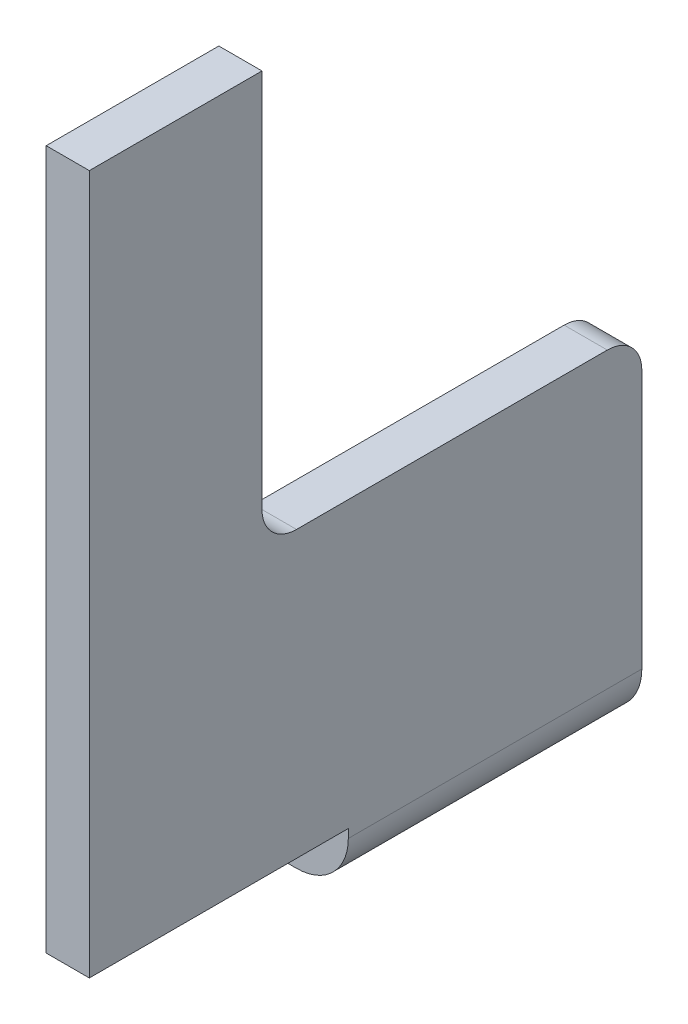
ISO-10303-21;
HEADER;
FILE_DESCRIPTION(('STEP AP214'),'2;1');
FILE_NAME('part.step','',(''),(''),'','','');
FILE_SCHEMA(('AUTOMOTIVE_DESIGN { 1 0 10303 214 1 1 1 1 }'));
ENDSEC;
DATA;
#1=APPLICATION_CONTEXT('core data for automotive mechanical design processes');
#2=APPLICATION_PROTOCOL_DEFINITION('international standard','automotive_design',2000,#1);
#3=PRODUCT_CONTEXT('',#1,'mechanical');
#4=PRODUCT('Part','Part','',(#3));
#5=PRODUCT_RELATED_PRODUCT_CATEGORY('part','',(#4));
#6=PRODUCT_DEFINITION_FORMATION('','',#4);
#7=PRODUCT_DEFINITION_CONTEXT('part definition',#1,'design');
#8=PRODUCT_DEFINITION('design','',#6,#7);
#9=PRODUCT_DEFINITION_SHAPE('','',#8);
#10=(LENGTH_UNIT() NAMED_UNIT(*) SI_UNIT(.MILLI.,.METRE.));
#11=(NAMED_UNIT(*) PLANE_ANGLE_UNIT() SI_UNIT($,.RADIAN.));
#12=(NAMED_UNIT(*) SI_UNIT($,.STERADIAN.) SOLID_ANGLE_UNIT());
#13=UNCERTAINTY_MEASURE_WITH_UNIT(LENGTH_MEASURE(1.E-05),#10,'distance_accuracy_value','');
#14=(GEOMETRIC_REPRESENTATION_CONTEXT(3) GLOBAL_UNCERTAINTY_ASSIGNED_CONTEXT((#13)) GLOBAL_UNIT_ASSIGNED_CONTEXT((#10,
#11,#12)) REPRESENTATION_CONTEXT('',''));
#15=CARTESIAN_POINT('',(0.,0.,0.));
#16=DIRECTION('',(0.,0.,1.));
#17=DIRECTION('',(1.,0.,0.));
#18=AXIS2_PLACEMENT_3D('',#15,#16,#17);
#19=CARTESIAN_POINT('',(2.375,-2.05,-10.4));
#20=DIRECTION('',(0.,0.,-1.));
#21=DIRECTION('',(-1.,0.,0.));
#22=AXIS2_PLACEMENT_3D('',#19,#20,#21);
#23=CYLINDRICAL_SURFACE('',#22,0.0999999999999998);
#24=DIRECTION('',(0.,0.,-1.));
#25=VECTOR('',#24,1.);
#26=CARTESIAN_POINT('',(2.475,-2.05,-8.2));
#27=LINE('',#26,#25);
#28=CARTESIAN_POINT('',(2.475,-2.05,-8.7));
#29=VERTEX_POINT('',#28);
#30=CARTESIAN_POINT('',(2.475,-2.05,-10.4));
#31=VERTEX_POINT('',#30);
#32=EDGE_CURVE('E226',#29,#31,#27,.T.);
#33=ORIENTED_EDGE('',*,*,#32,.T.);
#34=CARTESIAN_POINT('',(2.375,-2.05,-10.4));
#35=DIRECTION('',(0.,0.,-1.));
#36=DIRECTION('',(-1.,0.,0.));
#37=AXIS2_PLACEMENT_3D('',#34,#35,#36);
#38=CIRCLE('',#37,0.0999999999999998);
#39=CARTESIAN_POINT('',(2.375,-2.15,-10.4));
#40=VERTEX_POINT('',#39);
#41=EDGE_CURVE('E21',#40,#31,#38,.F.);
#42=ORIENTED_EDGE('',*,*,#41,.F.);
#43=DIRECTION('',(0.,0.,-1.));
#44=VECTOR('',#43,1.);
#45=CARTESIAN_POINT('',(2.375,-2.15,-10.4));
#46=LINE('',#45,#44);
#47=CARTESIAN_POINT('',(2.375,-2.15,-8.7));
#48=VERTEX_POINT('',#47);
#49=EDGE_CURVE('E193',#40,#48,#46,.F.);
#50=ORIENTED_EDGE('',*,*,#49,.T.);
#51=CARTESIAN_POINT('',(2.375,-2.05,-8.7));
#52=DIRECTION('',(0.,0.,-1.));
#53=DIRECTION('',(-1.,0.,0.));
#54=AXIS2_PLACEMENT_3D('',#51,#52,#53);
#55=CIRCLE('',#54,0.0999999999999998);
#56=EDGE_CURVE('E265',#29,#48,#55,.T.);
#57=ORIENTED_EDGE('',*,*,#56,.F.);
#58=EDGE_LOOP('',(#33,#42,#50,#57));
#59=FACE_BOUND('',#58,.T.);
#60=ADVANCED_FACE('F18',(#59),#23,.F.);
#61=CARTESIAN_POINT('',(1.375,-2.15,-9.25));
#62=DIRECTION('',(0.,1.,0.));
#63=DIRECTION('',(0.,0.,1.));
#64=AXIS2_PLACEMENT_3D('',#61,#62,#63);
#65=CYLINDRICAL_SURFACE('',#64,0.100000000000001);
#66=CARTESIAN_POINT('',(1.375,-2.15,-9.25));
#67=DIRECTION('',(0.,1.,0.));
#68=DIRECTION('',(0.,0.,1.));
#69=AXIS2_PLACEMENT_3D('',#66,#67,#68);
#70=CIRCLE('',#69,0.100000000000001);
#71=CARTESIAN_POINT('',(1.275,-2.15,-9.25));
#72=VERTEX_POINT('',#71);
#73=CARTESIAN_POINT('',(1.375,-2.15,-9.35));
#74=VERTEX_POINT('',#73);
#75=EDGE_CURVE('E190',#72,#74,#70,.F.);
#76=ORIENTED_EDGE('',*,*,#75,.T.);
#77=DIRECTION('',(0.,-1.,0.));
#78=VECTOR('',#77,1.);
#79=CARTESIAN_POINT('',(1.375,-2.15,-9.35));
#80=LINE('',#79,#78);
#81=CARTESIAN_POINT('',(1.375,-2.4,-9.35));
#82=VERTEX_POINT('',#81);
#83=EDGE_CURVE('E263',#74,#82,#80,.T.);
#84=ORIENTED_EDGE('',*,*,#83,.T.);
#85=CARTESIAN_POINT('',(1.375,-2.4,-9.25));
#86=DIRECTION('',(0.,1.,0.));
#87=DIRECTION('',(0.,0.,1.));
#88=AXIS2_PLACEMENT_3D('',#85,#86,#87);
#89=CIRCLE('',#88,0.100000000000001);
#90=CARTESIAN_POINT('',(1.275,-2.4,-9.25));
#91=VERTEX_POINT('',#90);
#92=EDGE_CURVE('E154',#82,#91,#89,.T.);
#93=ORIENTED_EDGE('',*,*,#92,.T.);
#94=DIRECTION('',(0.,1.,0.));
#95=VECTOR('',#94,1.);
#96=CARTESIAN_POINT('',(1.275,-2.4,-9.25));
#97=LINE('',#96,#95);
#98=EDGE_CURVE('E148',#91,#72,#97,.T.);
#99=ORIENTED_EDGE('',*,*,#98,.T.);
#100=EDGE_LOOP('',(#76,#84,#93,#99));
#101=FACE_BOUND('',#100,.T.);
#102=ADVANCED_FACE('F556',(#101),#65,.T.);
#103=CARTESIAN_POINT('',(1.8,-2.15,-9.35));
#104=DIRECTION('',(0.,0.,1.));
#105=DIRECTION('',(0.,-1.,0.));
#106=AXIS2_PLACEMENT_3D('',#103,#104,#105);
#107=PLANE('',#106);
#108=ORIENTED_EDGE('',*,*,#83,.F.);
#109=DIRECTION('',(1.,0.,0.));
#110=VECTOR('',#109,1.);
#111=CARTESIAN_POINT('',(1.275,-2.15,-9.35));
#112=LINE('',#111,#110);
#113=CARTESIAN_POINT('',(1.8,-2.15,-9.35));
#114=VERTEX_POINT('',#113);
#115=EDGE_CURVE('E187',#74,#114,#112,.T.);
#116=ORIENTED_EDGE('',*,*,#115,.T.);
#117=DIRECTION('',(0.,1.,0.));
#118=VECTOR('',#117,1.);
#119=CARTESIAN_POINT('',(1.8,-2.15,-9.35));
#120=LINE('',#119,#118);
#121=CARTESIAN_POINT('',(1.8,-2.4,-9.35));
#122=VERTEX_POINT('',#121);
#123=EDGE_CURVE('E261',#114,#122,#120,.F.);
#124=ORIENTED_EDGE('',*,*,#123,.T.);
#125=DIRECTION('',(1.,0.,0.));
#126=VECTOR('',#125,1.);
#127=CARTESIAN_POINT('',(2.425,-2.4,-9.35));
#128=LINE('',#127,#126);
#129=EDGE_CURVE('E213',#122,#82,#128,.F.);
#130=ORIENTED_EDGE('',*,*,#129,.T.);
#131=EDGE_LOOP('',(#108,#116,#124,#130));
#132=FACE_BOUND('',#131,.T.);
#133=ADVANCED_FACE('F546',(#132),#107,.F.);
#134=CARTESIAN_POINT('',(1.8,-2.15,-9.55));
#135=DIRECTION('',(0.,1.,0.));
#136=DIRECTION('',(0.,0.,1.));
#137=AXIS2_PLACEMENT_3D('',#134,#135,#136);
#138=CYLINDRICAL_SURFACE('',#137,0.200000000000001);
#139=ORIENTED_EDGE('',*,*,#123,.F.);
#140=CARTESIAN_POINT('',(1.8,-2.15,-9.55));
#141=DIRECTION('',(0.,1.,0.));
#142=DIRECTION('',(0.,0.,1.));
#143=AXIS2_PLACEMENT_3D('',#140,#141,#142);
#144=CIRCLE('',#143,0.200000000000001);
#145=CARTESIAN_POINT('',(1.8,-2.15,-9.75));
#146=VERTEX_POINT('',#145);
#147=EDGE_CURVE('E186',#114,#146,#144,.T.);
#148=ORIENTED_EDGE('',*,*,#147,.T.);
#149=DIRECTION('',(0.,1.,0.));
#150=VECTOR('',#149,1.);
#151=CARTESIAN_POINT('',(1.8,-2.15,-9.75));
#152=LINE('',#151,#150);
#153=CARTESIAN_POINT('',(1.8,-2.4,-9.75));
#154=VERTEX_POINT('',#153);
#155=EDGE_CURVE('E258',#146,#154,#152,.F.);
#156=ORIENTED_EDGE('',*,*,#155,.T.);
#157=CARTESIAN_POINT('',(1.8,-2.4,-9.55));
#158=DIRECTION('',(0.,1.,0.));
#159=DIRECTION('',(0.,0.,1.));
#160=AXIS2_PLACEMENT_3D('',#157,#158,#159);
#161=CIRCLE('',#160,0.200000000000001);
#162=EDGE_CURVE('E216',#154,#122,#161,.F.);
#163=ORIENTED_EDGE('',*,*,#162,.T.);
#164=EDGE_LOOP('',(#139,#148,#156,#163));
#165=FACE_BOUND('',#164,.T.);
#166=ADVANCED_FACE('F536',(#165),#138,.F.);
#167=CARTESIAN_POINT('',(1.8,-2.15,-9.75));
#168=DIRECTION('',(0.,0.,-1.));
#169=DIRECTION('',(-1.,0.,0.));
#170=AXIS2_PLACEMENT_3D('',#167,#168,#169);
#171=PLANE('',#170);
#172=ORIENTED_EDGE('',*,*,#155,.F.);
#173=DIRECTION('',(1.,0.,0.));
#174=VECTOR('',#173,1.);
#175=CARTESIAN_POINT('',(1.275,-2.15,-9.75));
#176=LINE('',#175,#174);
#177=CARTESIAN_POINT('',(1.375,-2.15,-9.75));
#178=VERTEX_POINT('',#177);
#179=EDGE_CURVE('E183',#146,#178,#176,.F.);
#180=ORIENTED_EDGE('',*,*,#179,.T.);
#181=DIRECTION('',(0.,1.,0.));
#182=VECTOR('',#181,1.);
#183=CARTESIAN_POINT('',(1.375,-2.15,-9.75));
#184=LINE('',#183,#182);
#185=CARTESIAN_POINT('',(1.375,-2.4,-9.75));
#186=VERTEX_POINT('',#185);
#187=EDGE_CURVE('E256',#186,#178,#184,.T.);
#188=ORIENTED_EDGE('',*,*,#187,.F.);
#189=DIRECTION('',(1.,0.,0.));
#190=VECTOR('',#189,1.);
#191=CARTESIAN_POINT('',(2.425,-2.4,-9.75));
#192=LINE('',#191,#190);
#193=EDGE_CURVE('E208',#186,#154,#192,.T.);
#194=ORIENTED_EDGE('',*,*,#193,.T.);
#195=EDGE_LOOP('',(#172,#180,#188,#194));
#196=FACE_BOUND('',#195,.T.);
#197=ADVANCED_FACE('F526',(#196),#171,.F.);
#198=CARTESIAN_POINT('',(1.375,-2.15,-9.85));
#199=DIRECTION('',(0.,1.,0.));
#200=DIRECTION('',(0.,0.,1.));
#201=AXIS2_PLACEMENT_3D('',#198,#199,#200);
#202=CYLINDRICAL_SURFACE('',#201,0.100000000000001);
#203=CARTESIAN_POINT('',(1.375,-2.15,-9.85));
#204=DIRECTION('',(0.,1.,0.));
#205=DIRECTION('',(0.,0.,1.));
#206=AXIS2_PLACEMENT_3D('',#203,#204,#205);
#207=CIRCLE('',#206,0.100000000000001);
#208=CARTESIAN_POINT('',(1.275,-2.15,-9.85));
#209=VERTEX_POINT('',#208);
#210=EDGE_CURVE('E180',#178,#209,#207,.F.);
#211=ORIENTED_EDGE('',*,*,#210,.T.);
#212=DIRECTION('',(0.,1.,0.));
#213=VECTOR('',#212,1.);
#214=CARTESIAN_POINT('',(1.275,-2.4,-9.85));
#215=LINE('',#214,#213);
#216=CARTESIAN_POINT('',(1.275,-2.4,-9.85));
#217=VERTEX_POINT('',#216);
#218=EDGE_CURVE('E205',#209,#217,#215,.F.);
#219=ORIENTED_EDGE('',*,*,#218,.T.);
#220=CARTESIAN_POINT('',(1.375,-2.4,-9.85));
#221=DIRECTION('',(0.,1.,0.));
#222=DIRECTION('',(0.,0.,1.));
#223=AXIS2_PLACEMENT_3D('',#220,#221,#222);
#224=CIRCLE('',#223,0.100000000000001);
#225=EDGE_CURVE('E153',#217,#186,#224,.T.);
#226=ORIENTED_EDGE('',*,*,#225,.T.);
#227=ORIENTED_EDGE('',*,*,#187,.T.);
#228=EDGE_LOOP('',(#211,#219,#226,#227));
#229=FACE_BOUND('',#228,.T.);
#230=ADVANCED_FACE('F517',(#229),#202,.T.);
#231=CARTESIAN_POINT('',(1.275,-2.4,-10.4));
#232=DIRECTION('',(1.,0.,0.));
#233=DIRECTION('',(0.,0.,-1.));
#234=AXIS2_PLACEMENT_3D('',#231,#232,#233);
#235=PLANE('',#234);
#236=DIRECTION('',(0.,0.,1.));
#237=VECTOR('',#236,1.);
#238=CARTESIAN_POINT('',(1.275,-2.4,-10.4));
#239=LINE('',#238,#237);
#240=CARTESIAN_POINT('',(1.275,-2.4,-8.7));
#241=VERTEX_POINT('',#240);
#242=EDGE_CURVE('E143',#91,#241,#239,.T.);
#243=ORIENTED_EDGE('',*,*,#242,.T.);
#244=DIRECTION('',(0.,1.,0.));
#245=VECTOR('',#244,1.);
#246=CARTESIAN_POINT('',(1.275,-2.05,-8.7));
#247=LINE('',#246,#245);
#248=CARTESIAN_POINT('',(1.275,-2.15,-8.7));
#249=VERTEX_POINT('',#248);
#250=EDGE_CURVE('E147',#241,#249,#247,.T.);
#251=ORIENTED_EDGE('',*,*,#250,.T.);
#252=DIRECTION('',(0.,0.,-1.));
#253=VECTOR('',#252,1.);
#254=CARTESIAN_POINT('',(1.275,-2.15,-10.4));
#255=LINE('',#254,#253);
#256=EDGE_CURVE('E191',#249,#72,#255,.T.);
#257=ORIENTED_EDGE('',*,*,#256,.T.);
#258=ORIENTED_EDGE('',*,*,#98,.F.);
#259=EDGE_LOOP('',(#243,#251,#257,#258));
#260=FACE_BOUND('',#259,.T.);
#261=ADVANCED_FACE('F145',(#260),#235,.F.);
#262=CARTESIAN_POINT('',(2.475,2.,-8.2));
#263=DIRECTION('',(1.,0.,0.));
#264=DIRECTION('',(0.,0.,-1.));
#265=AXIS2_PLACEMENT_3D('',#262,#263,#264);
#266=PLANE('',#265);
#267=CARTESIAN_POINT('',(2.475,-0.6,-10.2));
#268=DIRECTION('',(1.,0.,0.));
#269=DIRECTION('',(0.,0.,-1.));
#270=AXIS2_PLACEMENT_3D('',#267,#268,#269);
#271=CIRCLE('',#270,0.200000000000001);
#272=CARTESIAN_POINT('',(2.475,-0.6,-10.4));
#273=VERTEX_POINT('',#272);
#274=CARTESIAN_POINT('',(2.475,-0.4,-10.2));
#275=VERTEX_POINT('',#274);
#276=EDGE_CURVE('E225',#273,#275,#271,.T.);
#277=ORIENTED_EDGE('',*,*,#276,.F.);
#278=DIRECTION('',(0.,1.,0.));
#279=VECTOR('',#278,1.);
#280=CARTESIAN_POINT('',(2.475,2.,-10.4));
#281=LINE('',#280,#279);
#282=EDGE_CURVE('E223',#31,#273,#281,.T.);
#283=ORIENTED_EDGE('',*,*,#282,.F.);
#284=ORIENTED_EDGE('',*,*,#32,.F.);
#285=DIRECTION('',(0.,0.,1.));
#286=VECTOR('',#285,1.);
#287=CARTESIAN_POINT('',(2.475,-2.05,-8.2));
#288=LINE('',#287,#286);
#289=CARTESIAN_POINT('',(2.475,-2.05,-7.2));
#290=VERTEX_POINT('',#289);
#291=EDGE_CURVE('E245',#29,#290,#288,.T.);
#292=ORIENTED_EDGE('',*,*,#291,.T.);
#293=DIRECTION('',(0.,1.,0.));
#294=VECTOR('',#293,1.);
#295=CARTESIAN_POINT('',(2.475,-2.05,-7.2));
#296=LINE('',#295,#294);
#297=CARTESIAN_POINT('',(2.475,2.,-7.2));
#298=VERTEX_POINT('',#297);
#299=EDGE_CURVE('E237',#290,#298,#296,.T.);
#300=ORIENTED_EDGE('',*,*,#299,.T.);
#301=DIRECTION('',(0.,0.,-1.));
#302=VECTOR('',#301,1.);
#303=CARTESIAN_POINT('',(2.475,2.,-8.2));
#304=LINE('',#303,#302);
#305=CARTESIAN_POINT('',(2.475,2.,-8.2));
#306=VERTEX_POINT('',#305);
#307=EDGE_CURVE('E234',#298,#306,#304,.T.);
#308=ORIENTED_EDGE('',*,*,#307,.T.);
#309=DIRECTION('',(0.,1.,0.));
#310=VECTOR('',#309,1.);
#311=CARTESIAN_POINT('',(2.475,-2.05,-8.2));
#312=LINE('',#311,#310);
#313=CARTESIAN_POINT('',(2.475,-0.2,-8.2));
#314=VERTEX_POINT('',#313);
#315=EDGE_CURVE('E227',#314,#306,#312,.T.);
#316=ORIENTED_EDGE('',*,*,#315,.F.);
#317=CARTESIAN_POINT('',(2.475,-0.2,-8.4));
#318=DIRECTION('',(-1.,0.,0.));
#319=DIRECTION('',(0.,0.,1.));
#320=AXIS2_PLACEMENT_3D('',#317,#318,#319);
#321=CIRCLE('',#320,0.200000000000001);
#322=CARTESIAN_POINT('',(2.475,-0.4,-8.4));
#323=VERTEX_POINT('',#322);
#324=EDGE_CURVE('E277',#314,#323,#321,.F.);
#325=ORIENTED_EDGE('',*,*,#324,.T.);
#326=DIRECTION('',(0.,0.,-1.));
#327=VECTOR('',#326,1.);
#328=CARTESIAN_POINT('',(2.475,-0.4,-8.7));
#329=LINE('',#328,#327);
#330=EDGE_CURVE('E218',#323,#275,#329,.T.);
#331=ORIENTED_EDGE('',*,*,#330,.T.);
#332=EDGE_LOOP('',(#277,#283,#284,#292,#300,#308,#316,#325,#331));
#333=FACE_BOUND('',#332,.T.);
#334=ADVANCED_FACE('F296',(#333),#266,.F.);
#335=CARTESIAN_POINT('',(2.425,-2.4,-10.4));
#336=DIRECTION('',(0.,1.,0.));
#337=DIRECTION('',(0.,0.,1.));
#338=AXIS2_PLACEMENT_3D('',#335,#336,#337);
#339=PLANE('',#338);
#340=ORIENTED_EDGE('',*,*,#225,.F.);
#341=DIRECTION('',(0.,0.,-1.));
#342=VECTOR('',#341,1.);
#343=CARTESIAN_POINT('',(1.275,-2.4,-10.4));
#344=LINE('',#343,#342);
#345=CARTESIAN_POINT('',(1.275,-2.4,-10.4));
#346=VERTEX_POINT('',#345);
#347=EDGE_CURVE('E197',#217,#346,#344,.T.);
#348=ORIENTED_EDGE('',*,*,#347,.T.);
#349=DIRECTION('',(-1.,0.,0.));
#350=VECTOR('',#349,1.);
#351=CARTESIAN_POINT('',(2.375,-2.4,-10.4));
#352=LINE('',#351,#350);
#353=CARTESIAN_POINT('',(2.425,-2.4,-10.4));
#354=VERTEX_POINT('',#353);
#355=EDGE_CURVE('E200',#354,#346,#352,.T.);
#356=ORIENTED_EDGE('',*,*,#355,.F.);
#357=DIRECTION('',(0.,0.,-1.));
#358=VECTOR('',#357,1.);
#359=CARTESIAN_POINT('',(2.425,-2.4,-10.4));
#360=LINE('',#359,#358);
#361=CARTESIAN_POINT('',(2.425,-2.4,-8.7));
#362=VERTEX_POINT('',#361);
#363=EDGE_CURVE('E168',#362,#354,#360,.T.);
#364=ORIENTED_EDGE('',*,*,#363,.F.);
#365=DIRECTION('',(-1.,0.,0.));
#366=VECTOR('',#365,1.);
#367=CARTESIAN_POINT('',(2.375,-2.4,-8.7));
#368=LINE('',#367,#366);
#369=EDGE_CURVE('E161',#362,#241,#368,.T.);
#370=ORIENTED_EDGE('',*,*,#369,.T.);
#371=ORIENTED_EDGE('',*,*,#242,.F.);
#372=ORIENTED_EDGE('',*,*,#92,.F.);
#373=ORIENTED_EDGE('',*,*,#129,.F.);
#374=ORIENTED_EDGE('',*,*,#162,.F.);
#375=ORIENTED_EDGE('',*,*,#193,.F.);
#376=EDGE_LOOP('',(#340,#348,#356,#364,#370,#371,#372,#373,#374,#375));
#377=FACE_BOUND('',#376,.T.);
#378=ADVANCED_FACE('F166',(#377),#339,.F.);
#379=CARTESIAN_POINT('',(1.275,-2.4,-10.4));
#380=DIRECTION('',(1.,0.,0.));
#381=DIRECTION('',(0.,0.,-1.));
#382=AXIS2_PLACEMENT_3D('',#379,#380,#381);
#383=PLANE('',#382);
#384=ORIENTED_EDGE('',*,*,#218,.F.);
#385=DIRECTION('',(0.,0.,-1.));
#386=VECTOR('',#385,1.);
#387=CARTESIAN_POINT('',(1.275,-2.15,-10.4));
#388=LINE('',#387,#386);
#389=CARTESIAN_POINT('',(1.275,-2.15,-10.4));
#390=VERTEX_POINT('',#389);
#391=EDGE_CURVE('E178',#209,#390,#388,.T.);
#392=ORIENTED_EDGE('',*,*,#391,.T.);
#393=DIRECTION('',(0.,1.,0.));
#394=VECTOR('',#393,1.);
#395=CARTESIAN_POINT('',(1.275,-2.05,-10.4));
#396=LINE('',#395,#394);
#397=EDGE_CURVE('E132',#346,#390,#396,.T.);
#398=ORIENTED_EDGE('',*,*,#397,.F.);
#399=ORIENTED_EDGE('',*,*,#347,.F.);
#400=EDGE_LOOP('',(#384,#392,#398,#399));
#401=FACE_BOUND('',#400,.T.);
#402=ADVANCED_FACE('F501',(#401),#383,.F.);
#403=CARTESIAN_POINT('',(1.275,-2.15,-10.4));
#404=DIRECTION('',(0.,-1.,0.));
#405=DIRECTION('',(0.,0.,-1.));
#406=AXIS2_PLACEMENT_3D('',#403,#404,#405);
#407=PLANE('',#406);
#408=ORIENTED_EDGE('',*,*,#210,.F.);
#409=ORIENTED_EDGE('',*,*,#179,.F.);
#410=ORIENTED_EDGE('',*,*,#147,.F.);
#411=ORIENTED_EDGE('',*,*,#115,.F.);
#412=ORIENTED_EDGE('',*,*,#75,.F.);
#413=ORIENTED_EDGE('',*,*,#256,.F.);
#414=DIRECTION('',(-1.,0.,0.));
#415=VECTOR('',#414,1.);
#416=CARTESIAN_POINT('',(2.375,-2.15,-8.7));
#417=LINE('',#416,#415);
#418=EDGE_CURVE('E164',#249,#48,#417,.F.);
#419=ORIENTED_EDGE('',*,*,#418,.T.);
#420=ORIENTED_EDGE('',*,*,#49,.F.);
#421=DIRECTION('',(-1.,0.,0.));
#422=VECTOR('',#421,1.);
#423=CARTESIAN_POINT('',(2.375,-2.15,-10.4));
#424=LINE('',#423,#422);
#425=EDGE_CURVE('E199',#390,#40,#424,.F.);
#426=ORIENTED_EDGE('',*,*,#425,.F.);
#427=ORIENTED_EDGE('',*,*,#391,.F.);
#428=EDGE_LOOP('',(#408,#409,#410,#411,#412,#413,#419,#420,#426,#427));
#429=FACE_BOUND('',#428,.T.);
#430=ADVANCED_FACE('F300',(#429),#407,.F.);
#431=CARTESIAN_POINT('',(2.425,-2.1,-10.4));
#432=DIRECTION('',(0.,0.,-1.));
#433=DIRECTION('',(-1.,0.,0.));
#434=AXIS2_PLACEMENT_3D('',#431,#432,#433);
#435=CYLINDRICAL_SURFACE('',#434,0.3);
#436=CARTESIAN_POINT('',(2.425,-2.1,-10.4));
#437=DIRECTION('',(0.,0.,-1.));
#438=DIRECTION('',(-1.,0.,0.));
#439=AXIS2_PLACEMENT_3D('',#436,#437,#438);
#440=CIRCLE('',#439,0.3);
#441=CARTESIAN_POINT('',(2.725,-2.1,-10.4));
#442=VERTEX_POINT('',#441);
#443=EDGE_CURVE('E274',#442,#354,#440,.T.);
#444=ORIENTED_EDGE('',*,*,#443,.F.);
#445=DIRECTION('',(0.,0.,1.));
#446=VECTOR('',#445,1.);
#447=CARTESIAN_POINT('',(2.725,-2.1,-8.2));
#448=LINE('',#447,#446);
#449=CARTESIAN_POINT('',(2.725,-2.1,-8.7));
#450=VERTEX_POINT('',#449);
#451=EDGE_CURVE('E310',#442,#450,#448,.T.);
#452=ORIENTED_EDGE('',*,*,#451,.T.);
#453=CARTESIAN_POINT('',(2.425,-2.1,-8.7));
#454=DIRECTION('',(0.,0.,-1.));
#455=DIRECTION('',(-1.,0.,0.));
#456=AXIS2_PLACEMENT_3D('',#453,#454,#455);
#457=CIRCLE('',#456,0.3);
#458=EDGE_CURVE('E169',#450,#362,#457,.T.);
#459=ORIENTED_EDGE('',*,*,#458,.T.);
#460=ORIENTED_EDGE('',*,*,#363,.T.);
#461=EDGE_LOOP('',(#444,#452,#459,#460));
#462=FACE_BOUND('',#461,.T.);
#463=ADVANCED_FACE('F399',(#462),#435,.T.);
#464=CARTESIAN_POINT('',(2.375,-2.05,-8.7));
#465=DIRECTION('',(0.,0.,-1.));
#466=DIRECTION('',(-1.,0.,0.));
#467=AXIS2_PLACEMENT_3D('',#464,#465,#466);
#468=PLANE('',#467);
#469=DIRECTION('',(1.,0.,0.));
#470=VECTOR('',#469,1.);
#471=CARTESIAN_POINT('',(2.725,-2.05,-8.7));
#472=LINE('',#471,#470);
#473=CARTESIAN_POINT('',(2.725,-2.05,-8.7));
#474=VERTEX_POINT('',#473);
#475=EDGE_CURVE('E248',#474,#29,#472,.F.);
#476=ORIENTED_EDGE('',*,*,#475,.T.);
#477=ORIENTED_EDGE('',*,*,#56,.T.);
#478=ORIENTED_EDGE('',*,*,#418,.F.);
#479=ORIENTED_EDGE('',*,*,#250,.F.);
#480=ORIENTED_EDGE('',*,*,#369,.F.);
#481=ORIENTED_EDGE('',*,*,#458,.F.);
#482=DIRECTION('',(0.,1.,0.));
#483=VECTOR('',#482,1.);
#484=CARTESIAN_POINT('',(2.725,2.,-8.7));
#485=LINE('',#484,#483);
#486=EDGE_CURVE('E306',#450,#474,#485,.T.);
#487=ORIENTED_EDGE('',*,*,#486,.T.);
#488=EDGE_LOOP('',(#476,#477,#478,#479,#480,#481,#487));
#489=FACE_BOUND('',#488,.T.);
#490=ADVANCED_FACE('F160',(#489),#468,.F.);
#491=CARTESIAN_POINT('',(2.725,-2.05,-8.2));
#492=DIRECTION('',(0.,1.,0.));
#493=DIRECTION('',(0.,0.,1.));
#494=AXIS2_PLACEMENT_3D('',#491,#492,#493);
#495=PLANE('',#494);
#496=ORIENTED_EDGE('',*,*,#291,.F.);
#497=ORIENTED_EDGE('',*,*,#475,.F.);
#498=DIRECTION('',(0.,0.,1.));
#499=VECTOR('',#498,1.);
#500=CARTESIAN_POINT('',(2.725,-2.05,-8.2));
#501=LINE('',#500,#499);
#502=CARTESIAN_POINT('',(2.725,-2.05,-7.2));
#503=VERTEX_POINT('',#502);
#504=EDGE_CURVE('E309',#474,#503,#501,.T.);
#505=ORIENTED_EDGE('',*,*,#504,.T.);
#506=DIRECTION('',(-1.,0.,0.));
#507=VECTOR('',#506,1.);
#508=CARTESIAN_POINT('',(2.725,-2.05,-7.2));
#509=LINE('',#508,#507);
#510=EDGE_CURVE('E242',#503,#290,#509,.T.);
#511=ORIENTED_EDGE('',*,*,#510,.T.);
#512=EDGE_LOOP('',(#496,#497,#505,#511));
#513=FACE_BOUND('',#512,.T.);
#514=ADVANCED_FACE('F395',(#513),#495,.F.);
#515=CARTESIAN_POINT('',(2.725,-2.05,-7.2));
#516=DIRECTION('',(0.,0.,-1.));
#517=DIRECTION('',(-1.,0.,0.));
#518=AXIS2_PLACEMENT_3D('',#515,#516,#517);
#519=PLANE('',#518);
#520=DIRECTION('',(1.,0.,0.));
#521=VECTOR('',#520,1.);
#522=CARTESIAN_POINT('',(2.725,2.,-7.2));
#523=LINE('',#522,#521);
#524=CARTESIAN_POINT('',(2.725,2.,-7.2));
#525=VERTEX_POINT('',#524);
#526=EDGE_CURVE('E231',#525,#298,#523,.F.);
#527=ORIENTED_EDGE('',*,*,#526,.T.);
#528=ORIENTED_EDGE('',*,*,#299,.F.);
#529=ORIENTED_EDGE('',*,*,#510,.F.);
#530=DIRECTION('',(0.,1.,0.));
#531=VECTOR('',#530,1.);
#532=CARTESIAN_POINT('',(2.725,2.,-7.2));
#533=LINE('',#532,#531);
#534=EDGE_CURVE('E317',#503,#525,#533,.T.);
#535=ORIENTED_EDGE('',*,*,#534,.T.);
#536=EDGE_LOOP('',(#527,#528,#529,#535));
#537=FACE_BOUND('',#536,.T.);
#538=ADVANCED_FACE('F387',(#537),#519,.F.);
#539=CARTESIAN_POINT('',(2.725,2.,-8.2));
#540=DIRECTION('',(0.,-1.,0.));
#541=DIRECTION('',(0.,0.,-1.));
#542=AXIS2_PLACEMENT_3D('',#539,#540,#541);
#543=PLANE('',#542);
#544=DIRECTION('',(0.,0.,1.));
#545=VECTOR('',#544,1.);
#546=CARTESIAN_POINT('',(2.725,2.,-8.2));
#547=LINE('',#546,#545);
#548=CARTESIAN_POINT('',(2.725,2.,-8.2));
#549=VERTEX_POINT('',#548);
#550=EDGE_CURVE('E326',#525,#549,#547,.F.);
#551=ORIENTED_EDGE('',*,*,#550,.T.);
#552=DIRECTION('',(-1.,0.,0.));
#553=VECTOR('',#552,1.);
#554=CARTESIAN_POINT('',(2.725,2.,-8.2));
#555=LINE('',#554,#553);
#556=EDGE_CURVE('E230',#306,#549,#555,.F.);
#557=ORIENTED_EDGE('',*,*,#556,.F.);
#558=ORIENTED_EDGE('',*,*,#307,.F.);
#559=ORIENTED_EDGE('',*,*,#526,.F.);
#560=EDGE_LOOP('',(#551,#557,#558,#559));
#561=FACE_BOUND('',#560,.T.);
#562=ADVANCED_FACE('F380',(#561),#543,.F.);
#563=CARTESIAN_POINT('',(2.725,-2.05,-8.2));
#564=DIRECTION('',(0.,0.,-1.));
#565=DIRECTION('',(-1.,0.,0.));
#566=AXIS2_PLACEMENT_3D('',#563,#564,#565);
#567=PLANE('',#566);
#568=ORIENTED_EDGE('',*,*,#315,.T.);
#569=ORIENTED_EDGE('',*,*,#556,.T.);
#570=DIRECTION('',(0.,1.,0.));
#571=VECTOR('',#570,1.);
#572=CARTESIAN_POINT('',(2.725,2.,-8.2));
#573=LINE('',#572,#571);
#574=CARTESIAN_POINT('',(2.725,-0.2,-8.2));
#575=VERTEX_POINT('',#574);
#576=EDGE_CURVE('E273',#549,#575,#573,.F.);
#577=ORIENTED_EDGE('',*,*,#576,.T.);
#578=DIRECTION('',(-1.,0.,0.));
#579=VECTOR('',#578,1.);
#580=CARTESIAN_POINT('',(2.725,-0.2,-8.2));
#581=LINE('',#580,#579);
#582=EDGE_CURVE('E278',#575,#314,#581,.T.);
#583=ORIENTED_EDGE('',*,*,#582,.T.);
#584=EDGE_LOOP('',(#568,#569,#577,#583));
#585=FACE_BOUND('',#584,.T.);
#586=ADVANCED_FACE('F372',(#585),#567,.T.);
#587=CARTESIAN_POINT('',(2.725,-0.2,-8.4));
#588=DIRECTION('',(-1.,0.,0.));
#589=DIRECTION('',(0.,0.,1.));
#590=AXIS2_PLACEMENT_3D('',#587,#588,#589);
#591=CYLINDRICAL_SURFACE('',#590,0.200000000000001);
#592=ORIENTED_EDGE('',*,*,#582,.F.);
#593=CARTESIAN_POINT('',(2.725,-0.2,-8.4));
#594=DIRECTION('',(-1.,0.,0.));
#595=DIRECTION('',(0.,0.,1.));
#596=AXIS2_PLACEMENT_3D('',#593,#594,#595);
#597=CIRCLE('',#596,0.200000000000001);
#598=CARTESIAN_POINT('',(2.725,-0.4,-8.4));
#599=VERTEX_POINT('',#598);
#600=EDGE_CURVE('E270',#575,#599,#597,.F.);
#601=ORIENTED_EDGE('',*,*,#600,.T.);
#602=DIRECTION('',(1.,0.,0.));
#603=VECTOR('',#602,1.);
#604=CARTESIAN_POINT('',(2.725,-0.4,-8.4));
#605=LINE('',#604,#603);
#606=EDGE_CURVE('E222',#599,#323,#605,.F.);
#607=ORIENTED_EDGE('',*,*,#606,.T.);
#608=ORIENTED_EDGE('',*,*,#324,.F.);
#609=EDGE_LOOP('',(#592,#601,#607,#608));
#610=FACE_BOUND('',#609,.T.);
#611=ADVANCED_FACE('F369',(#610),#591,.F.);
#612=CARTESIAN_POINT('',(2.725,-0.4,-8.7));
#613=DIRECTION('',(0.,-1.,0.));
#614=DIRECTION('',(0.,0.,-1.));
#615=AXIS2_PLACEMENT_3D('',#612,#613,#614);
#616=PLANE('',#615);
#617=ORIENTED_EDGE('',*,*,#606,.F.);
#618=DIRECTION('',(0.,0.,1.));
#619=VECTOR('',#618,1.);
#620=CARTESIAN_POINT('',(2.725,-0.4,-8.2));
#621=LINE('',#620,#619);
#622=CARTESIAN_POINT('',(2.725,-0.4,-10.2));
#623=VERTEX_POINT('',#622);
#624=EDGE_CURVE('E269',#599,#623,#621,.F.);
#625=ORIENTED_EDGE('',*,*,#624,.T.);
#626=DIRECTION('',(1.,0.,0.));
#627=VECTOR('',#626,1.);
#628=CARTESIAN_POINT('',(2.375,-0.399999999999999,-10.2));
#629=LINE('',#628,#627);
#630=EDGE_CURVE('E221',#275,#623,#629,.T.);
#631=ORIENTED_EDGE('',*,*,#630,.F.);
#632=ORIENTED_EDGE('',*,*,#330,.F.);
#633=EDGE_LOOP('',(#617,#625,#631,#632));
#634=FACE_BOUND('',#633,.T.);
#635=ADVANCED_FACE('F361',(#634),#616,.F.);
#636=CARTESIAN_POINT('',(2.375,-0.6,-10.2));
#637=DIRECTION('',(1.,0.,0.));
#638=DIRECTION('',(0.,0.,-1.));
#639=AXIS2_PLACEMENT_3D('',#636,#637,#638);
#640=CYLINDRICAL_SURFACE('',#639,0.200000000000001);
#641=CARTESIAN_POINT('',(2.725,-0.6,-10.2));
#642=DIRECTION('',(1.,0.,0.));
#643=DIRECTION('',(0.,0.,-1.));
#644=AXIS2_PLACEMENT_3D('',#641,#642,#643);
#645=CIRCLE('',#644,0.200000000000001);
#646=CARTESIAN_POINT('',(2.725,-0.6,-10.4));
#647=VERTEX_POINT('',#646);
#648=EDGE_CURVE('E27',#623,#647,#645,.F.);
#649=ORIENTED_EDGE('',*,*,#648,.T.);
#650=DIRECTION('',(-1.,0.,0.));
#651=VECTOR('',#650,1.);
#652=CARTESIAN_POINT('',(2.375,-0.6,-10.4));
#653=LINE('',#652,#651);
#654=EDGE_CURVE('E35',#273,#647,#653,.F.);
#655=ORIENTED_EDGE('',*,*,#654,.F.);
#656=ORIENTED_EDGE('',*,*,#276,.T.);
#657=ORIENTED_EDGE('',*,*,#630,.T.);
#658=EDGE_LOOP('',(#649,#655,#656,#657));
#659=FACE_BOUND('',#658,.T.);
#660=ADVANCED_FACE('F401',(#659),#640,.T.);
#661=CARTESIAN_POINT('',(2.375,-2.05,-10.4));
#662=DIRECTION('',(0.,0.,-1.));
#663=DIRECTION('',(-1.,0.,0.));
#664=AXIS2_PLACEMENT_3D('',#661,#662,#663);
#665=PLANE('',#664);
#666=ORIENTED_EDGE('',*,*,#425,.T.);
#667=ORIENTED_EDGE('',*,*,#41,.T.);
#668=ORIENTED_EDGE('',*,*,#282,.T.);
#669=ORIENTED_EDGE('',*,*,#654,.T.);
#670=DIRECTION('',(0.,1.,0.));
#671=VECTOR('',#670,1.);
#672=CARTESIAN_POINT('',(2.725,2.,-10.4));
#673=LINE('',#672,#671);
#674=EDGE_CURVE('E11',#647,#442,#673,.F.);
#675=ORIENTED_EDGE('',*,*,#674,.T.);
#676=ORIENTED_EDGE('',*,*,#443,.T.);
#677=ORIENTED_EDGE('',*,*,#355,.T.);
#678=ORIENTED_EDGE('',*,*,#397,.T.);
#679=EDGE_LOOP('',(#666,#667,#668,#669,#675,#676,#677,#678));
#680=FACE_BOUND('',#679,.T.);
#681=ADVANCED_FACE('F292',(#680),#665,.T.);
#682=CARTESIAN_POINT('',(2.725,2.,-8.2));
#683=DIRECTION('',(-1.,0.,0.));
#684=DIRECTION('',(0.,0.,1.));
#685=AXIS2_PLACEMENT_3D('',#682,#683,#684);
#686=PLANE('',#685);
#687=ORIENTED_EDGE('',*,*,#648,.F.);
#688=ORIENTED_EDGE('',*,*,#624,.F.);
#689=ORIENTED_EDGE('',*,*,#600,.F.);
#690=ORIENTED_EDGE('',*,*,#576,.F.);
#691=ORIENTED_EDGE('',*,*,#550,.F.);
#692=ORIENTED_EDGE('',*,*,#534,.F.);
#693=ORIENTED_EDGE('',*,*,#504,.F.);
#694=ORIENTED_EDGE('',*,*,#486,.F.);
#695=ORIENTED_EDGE('',*,*,#451,.F.);
#696=ORIENTED_EDGE('',*,*,#674,.F.);
#697=EDGE_LOOP('',(#687,#688,#689,#690,#691,#692,#693,#694,#695,#696));
#698=FACE_BOUND('',#697,.T.);
#699=ADVANCED_FACE('F366',(#698),#686,.F.);
#700=CLOSED_SHELL('',(#60,#102,#133,#166,#197,#230,#261,#334,#378,#402,#430,#463,#490,#514,#538,
#562,#586,#611,#635,#660,#681,#699));
#701=MANIFOLD_SOLID_BREP('B1',#700);
#702=ADVANCED_BREP_SHAPE_REPRESENTATION('',(#18,#701),#14);
#703=SHAPE_DEFINITION_REPRESENTATION(#9,#702);
ENDSEC;
END-ISO-10303-21;
